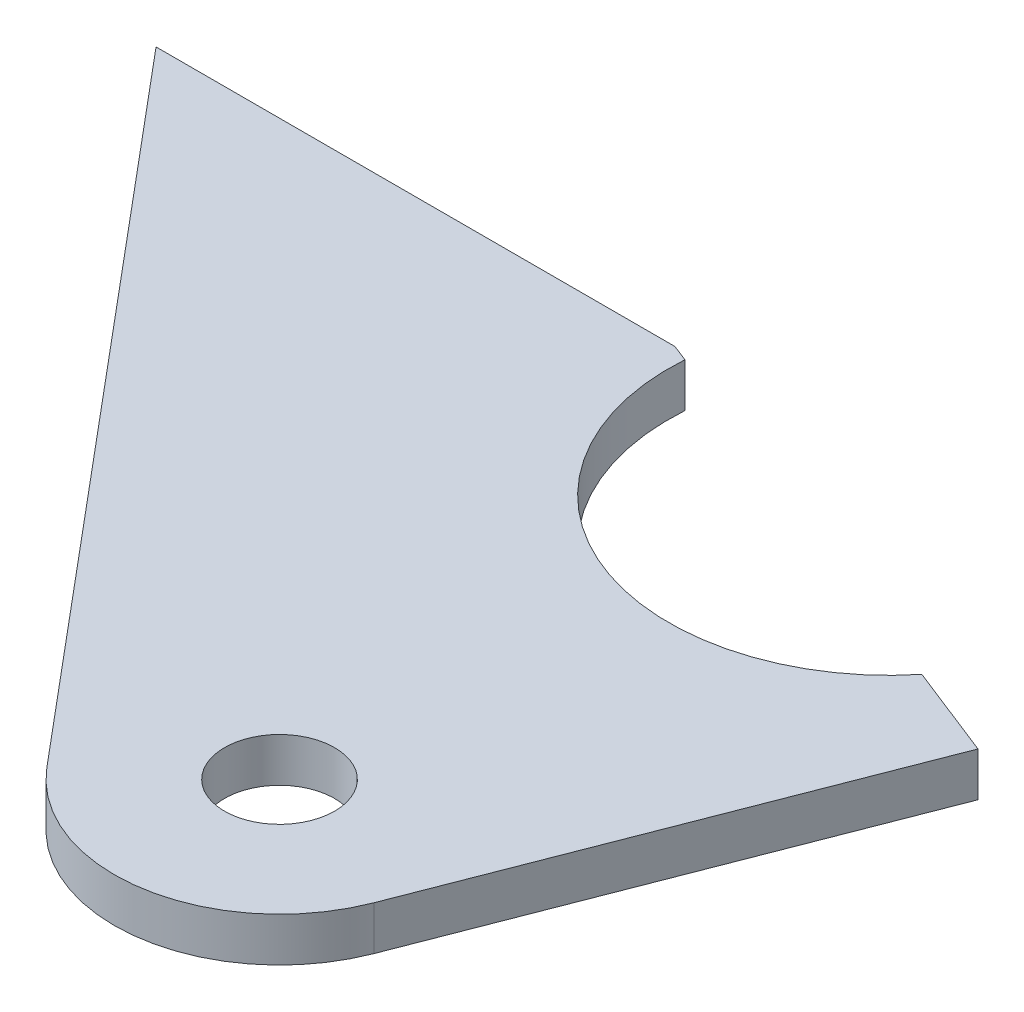
ISO-10303-21;
HEADER;
FILE_DESCRIPTION(('STEP AP214'),'2;1');
FILE_NAME('part.step','',(''),(''),'','','');
FILE_SCHEMA(('AUTOMOTIVE_DESIGN { 1 0 10303 214 1 1 1 1 }'));
ENDSEC;
DATA;
#1=APPLICATION_CONTEXT('core data for automotive mechanical design processes');
#2=APPLICATION_PROTOCOL_DEFINITION('international standard','automotive_design',2000,#1);
#3=PRODUCT_CONTEXT('',#1,'mechanical');
#4=PRODUCT('Part','Part','',(#3));
#5=PRODUCT_RELATED_PRODUCT_CATEGORY('part','',(#4));
#6=PRODUCT_DEFINITION_FORMATION('','',#4);
#7=PRODUCT_DEFINITION_CONTEXT('part definition',#1,'design');
#8=PRODUCT_DEFINITION('design','',#6,#7);
#9=PRODUCT_DEFINITION_SHAPE('','',#8);
#10=(LENGTH_UNIT() NAMED_UNIT(*) SI_UNIT(.MILLI.,.METRE.));
#11=(NAMED_UNIT(*) PLANE_ANGLE_UNIT() SI_UNIT($,.RADIAN.));
#12=(NAMED_UNIT(*) SI_UNIT($,.STERADIAN.) SOLID_ANGLE_UNIT());
#13=UNCERTAINTY_MEASURE_WITH_UNIT(LENGTH_MEASURE(1.E-05),#10,'distance_accuracy_value','');
#14=(GEOMETRIC_REPRESENTATION_CONTEXT(3) GLOBAL_UNCERTAINTY_ASSIGNED_CONTEXT((#13)) GLOBAL_UNIT_ASSIGNED_CONTEXT((#10,
#11,#12)) REPRESENTATION_CONTEXT('',''));
#15=CARTESIAN_POINT('',(0.,0.,0.));
#16=DIRECTION('',(0.,0.,1.));
#17=DIRECTION('',(1.,0.,0.));
#18=AXIS2_PLACEMENT_3D('',#15,#16,#17);
#19=CARTESIAN_POINT('',(-1156.55395395393,331.47,-448.561226059291));
#20=DIRECTION('',(0.932333717976393,0.,0.361599002106362));
#21=DIRECTION('',(0.361599002106362,0.,-0.932333717976393));
#22=AXIS2_PLACEMENT_3D('',#19,#20,#21);
#23=PLANE('',#22);
#24=DIRECTION('',(0.361599002106361,0.,-0.932333717976393));
#25=VECTOR('',#24,1.);
#26=CARTESIAN_POINT('',(-1156.55395395393,334.01,-448.561226059291));
#27=LINE('',#26,#25);
#28=CARTESIAN_POINT('',(-1400.81952133628,334.01,181.244230495063));
#29=VERTEX_POINT('',#28);
#30=CARTESIAN_POINT('',(-1391.08288865304,334.01,156.139650843989));
#31=VERTEX_POINT('',#30);
#32=EDGE_CURVE('E128',#29,#31,#27,.T.);
#33=ORIENTED_EDGE('',*,*,#32,.F.);
#34=DIRECTION('',(0.,1.,0.));
#35=VECTOR('',#34,1.);
#36=CARTESIAN_POINT('',(-1400.81952133628,331.47,181.244230495063));
#37=LINE('',#36,#35);
#38=CARTESIAN_POINT('',(-1400.81952133628,331.47,181.244230495063));
#39=VERTEX_POINT('',#38);
#40=EDGE_CURVE('E11',#39,#29,#37,.T.);
#41=ORIENTED_EDGE('',*,*,#40,.F.);
#42=DIRECTION('',(0.361599002106361,0.,-0.932333717976393));
#43=VECTOR('',#42,1.);
#44=CARTESIAN_POINT('',(-1156.55395395393,331.47,-448.561226059291));
#45=LINE('',#44,#43);
#46=CARTESIAN_POINT('',(-1391.08288865304,331.47,156.139650843989));
#47=VERTEX_POINT('',#46);
#48=EDGE_CURVE('E166',#39,#47,#45,.T.);
#49=ORIENTED_EDGE('',*,*,#48,.T.);
#50=DIRECTION('',(0.,1.,0.));
#51=VECTOR('',#50,1.);
#52=CARTESIAN_POINT('',(-1391.08288865304,331.47,156.139650843989));
#53=LINE('',#52,#51);
#54=EDGE_CURVE('E84',#47,#31,#53,.T.);
#55=ORIENTED_EDGE('',*,*,#54,.T.);
#56=EDGE_LOOP('',(#33,#41,#49,#55));
#57=FACE_BOUND('',#56,.T.);
#58=ADVANCED_FACE('F36',(#57),#23,.T.);
#59=CARTESIAN_POINT('',(-1409.7,331.47,177.8));
#60=DIRECTION('',(0.,1.,0.));
#61=DIRECTION('',(-1.,0.,0.));
#62=AXIS2_PLACEMENT_3D('',#59,#60,#61);
#63=CYLINDRICAL_SURFACE('',#62,9.52499999999983);
#64=CARTESIAN_POINT('',(-1409.7,334.01,177.8));
#65=DIRECTION('',(0.,-1.,0.));
#66=DIRECTION('',(1.,0.,0.));
#67=AXIS2_PLACEMENT_3D('',#64,#65,#66);
#68=CIRCLE('',#67,9.52499999999983);
#69=CARTESIAN_POINT('',(-1416.99657332071,334.01,183.922551982264));
#70=VERTEX_POINT('',#69);
#71=EDGE_CURVE('E131',#29,#70,#68,.T.);
#72=ORIENTED_EDGE('',*,*,#71,.T.);
#73=DIRECTION('',(0.,1.,0.));
#74=VECTOR('',#73,1.);
#75=CARTESIAN_POINT('',(-1416.99657332071,331.47,183.922551982264));
#76=LINE('',#75,#74);
#77=CARTESIAN_POINT('',(-1416.99657332071,331.47,183.922551982264));
#78=VERTEX_POINT('',#77);
#79=EDGE_CURVE('E45',#78,#70,#76,.T.);
#80=ORIENTED_EDGE('',*,*,#79,.F.);
#81=CARTESIAN_POINT('',(-1409.7,331.47,177.8));
#82=DIRECTION('',(0.,-1.,0.));
#83=DIRECTION('',(1.,0.,0.));
#84=AXIS2_PLACEMENT_3D('',#81,#82,#83);
#85=CIRCLE('',#84,9.52499999999983);
#86=EDGE_CURVE('E164',#39,#78,#85,.T.);
#87=ORIENTED_EDGE('',*,*,#86,.F.);
#88=ORIENTED_EDGE('',*,*,#40,.T.);
#89=EDGE_LOOP('',(#72,#80,#87,#88));
#90=FACE_BOUND('',#89,.T.);
#91=ADVANCED_FACE('F158',(#90),#63,.T.);
#92=CARTESIAN_POINT('',(-922.09190059204,331.47,773.726973698326));
#93=DIRECTION('',(-0.766044443118983,0.,0.642787609686534));
#94=DIRECTION('',(0.642787609686534,0.,0.766044443118983));
#95=AXIS2_PLACEMENT_3D('',#92,#93,#94);
#96=PLANE('',#95);
#97=DIRECTION('',(0.642787609686534,0.,0.766044443118983));
#98=VECTOR('',#97,1.);
#99=CARTESIAN_POINT('',(-922.09190059204,334.01,773.726973698326));
#100=LINE('',#99,#98);
#101=CARTESIAN_POINT('',(-1449.84107425236,334.01,144.78));
#102=VERTEX_POINT('',#101);
#103=EDGE_CURVE('E134',#102,#70,#100,.T.);
#104=ORIENTED_EDGE('',*,*,#103,.F.);
#105=DIRECTION('',(0.,1.,0.));
#106=VECTOR('',#105,1.);
#107=CARTESIAN_POINT('',(-1449.84107425236,331.47,144.78));
#108=LINE('',#107,#106);
#109=CARTESIAN_POINT('',(-1449.84107425236,331.47,144.78));
#110=VERTEX_POINT('',#109);
#111=EDGE_CURVE('E149',#110,#102,#108,.T.);
#112=ORIENTED_EDGE('',*,*,#111,.F.);
#113=DIRECTION('',(0.642787609686534,0.,0.766044443118983));
#114=VECTOR('',#113,1.);
#115=CARTESIAN_POINT('',(-922.09190059204,331.47,773.726973698326));
#116=LINE('',#115,#114);
#117=EDGE_CURVE('E155',#110,#78,#116,.T.);
#118=ORIENTED_EDGE('',*,*,#117,.T.);
#119=ORIENTED_EDGE('',*,*,#79,.T.);
#120=EDGE_LOOP('',(#104,#112,#118,#119));
#121=FACE_BOUND('',#120,.T.);
#122=ADVANCED_FACE('F154',(#121),#96,.T.);
#123=CARTESIAN_POINT('',(2.22044604925031E-13,331.47,144.78));
#124=DIRECTION('',(0.,0.,1.));
#125=DIRECTION('',(0.,-1.,0.));
#126=AXIS2_PLACEMENT_3D('',#123,#124,#125);
#127=PLANE('',#126);
#128=DIRECTION('',(1.,0.,0.));
#129=VECTOR('',#128,1.);
#130=CARTESIAN_POINT('',(2.22044604925031E-13,334.01,144.78));
#131=LINE('',#130,#129);
#132=CARTESIAN_POINT('',(-1419.92037114595,334.01,144.78));
#133=VERTEX_POINT('',#132);
#134=EDGE_CURVE('E137',#102,#133,#131,.T.);
#135=ORIENTED_EDGE('',*,*,#134,.T.);
#136=DIRECTION('',(0.,1.,0.));
#137=VECTOR('',#136,1.);
#138=CARTESIAN_POINT('',(-1419.92037114595,331.47,144.78));
#139=LINE('',#138,#137);
#140=CARTESIAN_POINT('',(-1419.92037114595,331.47,144.78));
#141=VERTEX_POINT('',#140);
#142=EDGE_CURVE('E118',#141,#133,#139,.T.);
#143=ORIENTED_EDGE('',*,*,#142,.F.);
#144=DIRECTION('',(1.,0.,0.));
#145=VECTOR('',#144,1.);
#146=CARTESIAN_POINT('',(2.22044604925031E-13,331.47,144.78));
#147=LINE('',#146,#145);
#148=EDGE_CURVE('E106',#110,#141,#147,.T.);
#149=ORIENTED_EDGE('',*,*,#148,.F.);
#150=ORIENTED_EDGE('',*,*,#111,.T.);
#151=EDGE_LOOP('',(#135,#143,#149,#150));
#152=FACE_BOUND('',#151,.T.);
#153=ADVANCED_FACE('F163',(#152),#127,.F.);
#154=CARTESIAN_POINT('',(-240.106563699217,331.47,609.531835282753));
#155=DIRECTION('',(-0.366508611464749,0.,0.930414659021547));
#156=DIRECTION('',(0.930414659021547,0.,0.366508611464749));
#157=AXIS2_PLACEMENT_3D('',#154,#155,#156);
#158=PLANE('',#157);
#159=DIRECTION('',(0.930414659021547,0.,0.366508611464749));
#160=VECTOR('',#159,1.);
#161=CARTESIAN_POINT('',(-240.106563699217,334.01,609.531835282753));
#162=LINE('',#161,#160);
#163=CARTESIAN_POINT('',(-1418.96937055922,334.01,145.154617812782));
#164=VERTEX_POINT('',#163);
#165=EDGE_CURVE('E114',#133,#164,#162,.T.);
#166=ORIENTED_EDGE('',*,*,#165,.T.);
#167=DIRECTION('',(0.,1.,0.));
#168=VECTOR('',#167,1.);
#169=CARTESIAN_POINT('',(-1418.96937055922,331.47,145.154617812782));
#170=LINE('',#169,#168);
#171=CARTESIAN_POINT('',(-1418.96937055922,331.47,145.154617812782));
#172=VERTEX_POINT('',#171);
#173=EDGE_CURVE('E112',#172,#164,#170,.T.);
#174=ORIENTED_EDGE('',*,*,#173,.F.);
#175=DIRECTION('',(0.930414659021547,0.,0.366508611464749));
#176=VECTOR('',#175,1.);
#177=CARTESIAN_POINT('',(-240.106563699217,331.47,609.531835282753));
#178=LINE('',#177,#176);
#179=EDGE_CURVE('E99',#141,#172,#178,.T.);
#180=ORIENTED_EDGE('',*,*,#179,.F.);
#181=ORIENTED_EDGE('',*,*,#142,.T.);
#182=EDGE_LOOP('',(#166,#174,#180,#181));
#183=FACE_BOUND('',#182,.T.);
#184=ADVANCED_FACE('F113',(#183),#158,.F.);
#185=CARTESIAN_POINT('',(-1406.30097323601,331.47,146.05));
#186=DIRECTION('',(0.,1.,0.));
#187=DIRECTION('',(-1.,0.,0.));
#188=AXIS2_PLACEMENT_3D('',#185,#186,#187);
#189=CYLINDRICAL_SURFACE('',#188,12.7);
#190=CARTESIAN_POINT('',(-1406.30097323601,334.01,146.05));
#191=DIRECTION('',(0.,-1.,0.));
#192=DIRECTION('',(1.,0.,0.));
#193=AXIS2_PLACEMENT_3D('',#190,#191,#192);
#194=CIRCLE('',#193,12.7);
#195=CARTESIAN_POINT('',(-1396.42537153216,334.01,154.035141888963));
#196=VERTEX_POINT('',#195);
#197=EDGE_CURVE('E141',#196,#164,#194,.T.);
#198=ORIENTED_EDGE('',*,*,#197,.F.);
#199=DIRECTION('',(0.,1.,0.));
#200=VECTOR('',#199,1.);
#201=CARTESIAN_POINT('',(-1396.42537153216,331.47,154.035141888963));
#202=LINE('',#201,#200);
#203=CARTESIAN_POINT('',(-1396.42537153216,331.47,154.035141888963));
#204=VERTEX_POINT('',#203);
#205=EDGE_CURVE('E77',#204,#196,#202,.T.);
#206=ORIENTED_EDGE('',*,*,#205,.F.);
#207=CARTESIAN_POINT('',(-1406.30097323601,331.47,146.05));
#208=DIRECTION('',(0.,-1.,0.));
#209=DIRECTION('',(1.,0.,0.));
#210=AXIS2_PLACEMENT_3D('',#207,#208,#209);
#211=CIRCLE('',#210,12.7);
#212=EDGE_CURVE('E103',#204,#172,#211,.T.);
#213=ORIENTED_EDGE('',*,*,#212,.T.);
#214=ORIENTED_EDGE('',*,*,#173,.T.);
#215=EDGE_LOOP('',(#198,#206,#213,#214));
#216=FACE_BOUND('',#215,.T.);
#217=ADVANCED_FACE('F120',(#216),#189,.F.);
#218=CARTESIAN_POINT('',(-1409.7,331.47,177.8));
#219=DIRECTION('',(0.,1.,0.));
#220=DIRECTION('',(-1.,0.,0.));
#221=AXIS2_PLACEMENT_3D('',#218,#219,#220);
#222=CYLINDRICAL_SURFACE('',#221,3.17499999999986);
#223=CARTESIAN_POINT('',(-1409.7,331.47,177.8));
#224=DIRECTION('',(0.,-1.,0.));
#225=DIRECTION('',(1.,0.,0.));
#226=AXIS2_PLACEMENT_3D('',#223,#224,#225);
#227=CIRCLE('',#226,3.17499999999986);
#228=CARTESIAN_POINT('',(-1406.525,331.47,177.8));
#229=VERTEX_POINT('',#228);
#230=EDGE_CURVE('E145',#229,#229,#227,.T.);
#231=ORIENTED_EDGE('',*,*,#230,.T.);
#232=EDGE_LOOP('',(#231));
#233=FACE_BOUND('',#232,.T.);
#234=CARTESIAN_POINT('',(-1409.7,334.01,177.8));
#235=DIRECTION('',(0.,-1.,0.));
#236=DIRECTION('',(1.,0.,0.));
#237=AXIS2_PLACEMENT_3D('',#234,#235,#236);
#238=CIRCLE('',#237,3.17499999999986);
#239=CARTESIAN_POINT('',(-1406.525,334.01,177.8));
#240=VERTEX_POINT('',#239);
#241=EDGE_CURVE('E125',#240,#240,#238,.T.);
#242=ORIENTED_EDGE('',*,*,#241,.F.);
#243=EDGE_LOOP('',(#242));
#244=FACE_BOUND('',#243,.T.);
#245=ADVANCED_FACE('F38',(#233,#244),#222,.F.);
#246=CARTESIAN_POINT('',(-240.106563699217,331.47,609.531835282753));
#247=DIRECTION('',(-0.366508611464749,0.,0.930414659021547));
#248=DIRECTION('',(0.930414659021547,0.,0.366508611464749));
#249=AXIS2_PLACEMENT_3D('',#246,#247,#248);
#250=PLANE('',#249);
#251=DIRECTION('',(0.930414659021547,0.,0.366508611464749));
#252=VECTOR('',#251,1.);
#253=CARTESIAN_POINT('',(-240.106563699217,334.01,609.531835282753));
#254=LINE('',#253,#252);
#255=EDGE_CURVE('E143',#196,#31,#254,.T.);
#256=ORIENTED_EDGE('',*,*,#255,.T.);
#257=ORIENTED_EDGE('',*,*,#54,.F.);
#258=DIRECTION('',(0.930414659021547,0.,0.366508611464749));
#259=VECTOR('',#258,1.);
#260=CARTESIAN_POINT('',(-240.106563699217,331.47,609.531835282753));
#261=LINE('',#260,#259);
#262=EDGE_CURVE('E53',#204,#47,#261,.T.);
#263=ORIENTED_EDGE('',*,*,#262,.F.);
#264=ORIENTED_EDGE('',*,*,#205,.T.);
#265=EDGE_LOOP('',(#256,#257,#263,#264));
#266=FACE_BOUND('',#265,.T.);
#267=ADVANCED_FACE('F176',(#266),#250,.F.);
#268=CARTESIAN_POINT('',(-2.22044604925031E-13,331.47,0.));
#269=DIRECTION('',(0.,-1.,0.));
#270=DIRECTION('',(1.,0.,0.));
#271=AXIS2_PLACEMENT_3D('',#268,#269,#270);
#272=PLANE('',#271);
#273=ORIENTED_EDGE('',*,*,#230,.F.);
#274=EDGE_LOOP('',(#273));
#275=FACE_BOUND('',#274,.T.);
#276=ORIENTED_EDGE('',*,*,#48,.F.);
#277=ORIENTED_EDGE('',*,*,#86,.T.);
#278=ORIENTED_EDGE('',*,*,#117,.F.);
#279=ORIENTED_EDGE('',*,*,#148,.T.);
#280=ORIENTED_EDGE('',*,*,#179,.T.);
#281=ORIENTED_EDGE('',*,*,#212,.F.);
#282=ORIENTED_EDGE('',*,*,#262,.T.);
#283=EDGE_LOOP('',(#276,#277,#278,#279,#280,#281,#282));
#284=FACE_BOUND('',#283,.T.);
#285=ADVANCED_FACE('F101',(#275,#284),#272,.T.);
#286=CARTESIAN_POINT('',(-2.22044604925031E-13,334.01,0.));
#287=DIRECTION('',(0.,-1.,0.));
#288=DIRECTION('',(1.,0.,0.));
#289=AXIS2_PLACEMENT_3D('',#286,#287,#288);
#290=PLANE('',#289);
#291=ORIENTED_EDGE('',*,*,#241,.T.);
#292=EDGE_LOOP('',(#291));
#293=FACE_BOUND('',#292,.T.);
#294=ORIENTED_EDGE('',*,*,#32,.T.);
#295=ORIENTED_EDGE('',*,*,#255,.F.);
#296=ORIENTED_EDGE('',*,*,#197,.T.);
#297=ORIENTED_EDGE('',*,*,#165,.F.);
#298=ORIENTED_EDGE('',*,*,#134,.F.);
#299=ORIENTED_EDGE('',*,*,#103,.T.);
#300=ORIENTED_EDGE('',*,*,#71,.F.);
#301=EDGE_LOOP('',(#294,#295,#296,#297,#298,#299,#300));
#302=FACE_BOUND('',#301,.T.);
#303=ADVANCED_FACE('F161',(#293,#302),#290,.F.);
#304=CLOSED_SHELL('',(#58,#91,#122,#153,#184,#217,#245,#267,#285,#303));
#305=MANIFOLD_SOLID_BREP('B2',#304);
#306=ADVANCED_BREP_SHAPE_REPRESENTATION('',(#18,#305),#14);
#307=SHAPE_DEFINITION_REPRESENTATION(#9,#306);
ENDSEC;
END-ISO-10303-21;
